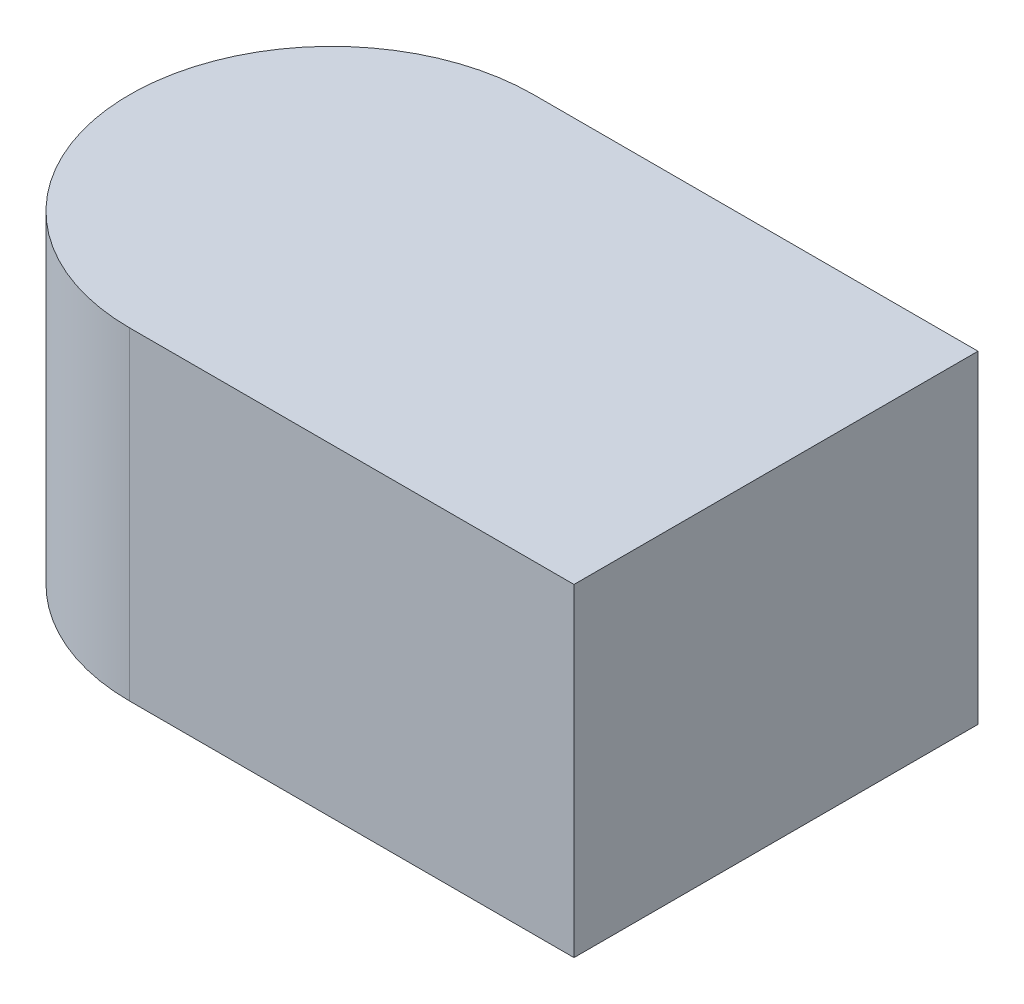
ISO-10303-21;
HEADER;
FILE_DESCRIPTION(('STEP AP214'),'2;1');
FILE_NAME('part.step','',(''),(''),'','','');
FILE_SCHEMA(('AUTOMOTIVE_DESIGN { 1 0 10303 214 1 1 1 1 }'));
ENDSEC;
DATA;
#1=APPLICATION_CONTEXT('core data for automotive mechanical design processes');
#2=APPLICATION_PROTOCOL_DEFINITION('international standard','automotive_design',2000,#1);
#3=PRODUCT_CONTEXT('',#1,'mechanical');
#4=PRODUCT('Part','Part','',(#3));
#5=PRODUCT_RELATED_PRODUCT_CATEGORY('part','',(#4));
#6=PRODUCT_DEFINITION_FORMATION('','',#4);
#7=PRODUCT_DEFINITION_CONTEXT('part definition',#1,'design');
#8=PRODUCT_DEFINITION('design','',#6,#7);
#9=PRODUCT_DEFINITION_SHAPE('','',#8);
#10=(LENGTH_UNIT() NAMED_UNIT(*) SI_UNIT(.MILLI.,.METRE.));
#11=(NAMED_UNIT(*) PLANE_ANGLE_UNIT() SI_UNIT($,.RADIAN.));
#12=(NAMED_UNIT(*) SI_UNIT($,.STERADIAN.) SOLID_ANGLE_UNIT());
#13=UNCERTAINTY_MEASURE_WITH_UNIT(LENGTH_MEASURE(1.E-05),#10,'distance_accuracy_value','');
#14=(GEOMETRIC_REPRESENTATION_CONTEXT(3) GLOBAL_UNCERTAINTY_ASSIGNED_CONTEXT((#13)) GLOBAL_UNIT_ASSIGNED_CONTEXT((#10,
#11,#12)) REPRESENTATION_CONTEXT('',''));
#15=CARTESIAN_POINT('',(0.,0.,0.));
#16=DIRECTION('',(0.,0.,1.));
#17=DIRECTION('',(1.,0.,0.));
#18=AXIS2_PLACEMENT_3D('',#15,#16,#17);
#19=CARTESIAN_POINT('',(0.,0.,0.));
#20=DIRECTION('',(0.,1.,0.));
#21=DIRECTION('',(1.,0.,0.));
#22=AXIS2_PLACEMENT_3D('',#19,#20,#21);
#23=PLANE('',#22);
#24=DIRECTION('',(0.,0.,-1.));
#25=VECTOR('',#24,1.);
#26=CARTESIAN_POINT('',(1.5,0.,0.875));
#27=LINE('',#26,#25);
#28=CARTESIAN_POINT('',(1.5,0.,0.875));
#29=VERTEX_POINT('',#28);
#30=CARTESIAN_POINT('',(1.5,0.,0.625));
#31=VERTEX_POINT('',#30);
#32=EDGE_CURVE('E11',#29,#31,#27,.T.);
#33=ORIENTED_EDGE('',*,*,#32,.F.);
#34=DIRECTION('',(1.,0.,0.));
#35=VECTOR('',#34,1.);
#36=CARTESIAN_POINT('',(1.225,0.,0.875));
#37=LINE('',#36,#35);
#38=CARTESIAN_POINT('',(1.225,0.,0.875));
#39=VERTEX_POINT('',#38);
#40=EDGE_CURVE('E24',#39,#29,#37,.T.);
#41=ORIENTED_EDGE('',*,*,#40,.F.);
#42=CARTESIAN_POINT('',(1.225,0.,0.75));
#43=DIRECTION('',(0.,1.,0.));
#44=DIRECTION('',(0.,0.,-1.));
#45=AXIS2_PLACEMENT_3D('',#42,#43,#44);
#46=CIRCLE('',#45,0.125);
#47=CARTESIAN_POINT('',(1.225,0.,0.625));
#48=VERTEX_POINT('',#47);
#49=EDGE_CURVE('E61',#48,#39,#46,.T.);
#50=ORIENTED_EDGE('',*,*,#49,.F.);
#51=DIRECTION('',(-1.,0.,0.));
#52=VECTOR('',#51,1.);
#53=CARTESIAN_POINT('',(1.5,0.,0.625));
#54=LINE('',#53,#52);
#55=EDGE_CURVE('E37',#31,#48,#54,.T.);
#56=ORIENTED_EDGE('',*,*,#55,.F.);
#57=EDGE_LOOP('',(#33,#41,#50,#56));
#58=FACE_BOUND('',#57,.T.);
#59=ADVANCED_FACE('F17',(#58),#23,.F.);
#60=CARTESIAN_POINT('',(1.5,0.,0.625));
#61=DIRECTION('',(0.,0.,-1.));
#62=DIRECTION('',(-1.,0.,0.));
#63=AXIS2_PLACEMENT_3D('',#60,#61,#62);
#64=PLANE('',#63);
#65=DIRECTION('',(0.,1.,0.));
#66=VECTOR('',#65,1.);
#67=CARTESIAN_POINT('',(1.225,0.,0.625));
#68=LINE('',#67,#66);
#69=CARTESIAN_POINT('',(1.225,0.2,0.625));
#70=VERTEX_POINT('',#69);
#71=EDGE_CURVE('E84',#48,#70,#68,.T.);
#72=ORIENTED_EDGE('',*,*,#71,.T.);
#73=DIRECTION('',(-1.,0.,0.));
#74=VECTOR('',#73,1.);
#75=CARTESIAN_POINT('',(1.5,0.2,0.625));
#76=LINE('',#75,#74);
#77=CARTESIAN_POINT('',(1.5,0.2,0.625));
#78=VERTEX_POINT('',#77);
#79=EDGE_CURVE('E74',#78,#70,#76,.T.);
#80=ORIENTED_EDGE('',*,*,#79,.F.);
#81=DIRECTION('',(0.,1.,0.));
#82=VECTOR('',#81,1.);
#83=CARTESIAN_POINT('',(1.5,0.,0.625));
#84=LINE('',#83,#82);
#85=EDGE_CURVE('E81',#31,#78,#84,.T.);
#86=ORIENTED_EDGE('',*,*,#85,.F.);
#87=ORIENTED_EDGE('',*,*,#55,.T.);
#88=EDGE_LOOP('',(#72,#80,#86,#87));
#89=FACE_BOUND('',#88,.T.);
#90=ADVANCED_FACE('F89',(#89),#64,.T.);
#91=CARTESIAN_POINT('',(1.5,0.,0.875));
#92=DIRECTION('',(1.,0.,0.));
#93=DIRECTION('',(0.,0.,-1.));
#94=AXIS2_PLACEMENT_3D('',#91,#92,#93);
#95=PLANE('',#94);
#96=ORIENTED_EDGE('',*,*,#85,.T.);
#97=DIRECTION('',(0.,0.,-1.));
#98=VECTOR('',#97,1.);
#99=CARTESIAN_POINT('',(1.5,0.2,0.875));
#100=LINE('',#99,#98);
#101=CARTESIAN_POINT('',(1.5,0.2,0.875));
#102=VERTEX_POINT('',#101);
#103=EDGE_CURVE('E79',#102,#78,#100,.T.);
#104=ORIENTED_EDGE('',*,*,#103,.F.);
#105=DIRECTION('',(0.,1.,0.));
#106=VECTOR('',#105,1.);
#107=CARTESIAN_POINT('',(1.5,0.,0.875));
#108=LINE('',#107,#106);
#109=EDGE_CURVE('E67',#29,#102,#108,.T.);
#110=ORIENTED_EDGE('',*,*,#109,.F.);
#111=ORIENTED_EDGE('',*,*,#32,.T.);
#112=EDGE_LOOP('',(#96,#104,#110,#111));
#113=FACE_BOUND('',#112,.T.);
#114=ADVANCED_FACE('F91',(#113),#95,.T.);
#115=CARTESIAN_POINT('',(1.225,0.,0.875));
#116=DIRECTION('',(0.,0.,1.));
#117=DIRECTION('',(1.,0.,0.));
#118=AXIS2_PLACEMENT_3D('',#115,#116,#117);
#119=PLANE('',#118);
#120=ORIENTED_EDGE('',*,*,#109,.T.);
#121=DIRECTION('',(1.,0.,0.));
#122=VECTOR('',#121,1.);
#123=CARTESIAN_POINT('',(1.225,0.2,0.875));
#124=LINE('',#123,#122);
#125=CARTESIAN_POINT('',(1.225,0.2,0.875));
#126=VERTEX_POINT('',#125);
#127=EDGE_CURVE('E62',#126,#102,#124,.T.);
#128=ORIENTED_EDGE('',*,*,#127,.F.);
#129=DIRECTION('',(0.,1.,0.));
#130=VECTOR('',#129,1.);
#131=CARTESIAN_POINT('',(1.225,0.,0.875));
#132=LINE('',#131,#130);
#133=EDGE_CURVE('E55',#39,#126,#132,.T.);
#134=ORIENTED_EDGE('',*,*,#133,.F.);
#135=ORIENTED_EDGE('',*,*,#40,.T.);
#136=EDGE_LOOP('',(#120,#128,#134,#135));
#137=FACE_BOUND('',#136,.T.);
#138=ADVANCED_FACE('F65',(#137),#119,.T.);
#139=CARTESIAN_POINT('',(1.225,0.,0.75));
#140=DIRECTION('',(0.,1.,0.));
#141=DIRECTION('',(1.,0.,0.));
#142=AXIS2_PLACEMENT_3D('',#139,#140,#141);
#143=CYLINDRICAL_SURFACE('',#142,0.125);
#144=ORIENTED_EDGE('',*,*,#133,.T.);
#145=CARTESIAN_POINT('',(1.225,0.2,0.75));
#146=DIRECTION('',(0.,1.,0.));
#147=DIRECTION('',(0.,0.,-1.));
#148=AXIS2_PLACEMENT_3D('',#145,#146,#147);
#149=CIRCLE('',#148,0.125);
#150=EDGE_CURVE('E60',#70,#126,#149,.T.);
#151=ORIENTED_EDGE('',*,*,#150,.F.);
#152=ORIENTED_EDGE('',*,*,#71,.F.);
#153=ORIENTED_EDGE('',*,*,#49,.T.);
#154=EDGE_LOOP('',(#144,#151,#152,#153));
#155=FACE_BOUND('',#154,.T.);
#156=ADVANCED_FACE('F57',(#155),#143,.T.);
#157=CARTESIAN_POINT('',(0.,0.2,0.));
#158=DIRECTION('',(0.,1.,0.));
#159=DIRECTION('',(1.,0.,0.));
#160=AXIS2_PLACEMENT_3D('',#157,#158,#159);
#161=PLANE('',#160);
#162=ORIENTED_EDGE('',*,*,#150,.T.);
#163=ORIENTED_EDGE('',*,*,#127,.T.);
#164=ORIENTED_EDGE('',*,*,#103,.T.);
#165=ORIENTED_EDGE('',*,*,#79,.T.);
#166=EDGE_LOOP('',(#162,#163,#164,#165));
#167=FACE_BOUND('',#166,.T.);
#168=ADVANCED_FACE('F72',(#167),#161,.T.);
#169=CLOSED_SHELL('',(#59,#90,#114,#138,#156,#168));
#170=MANIFOLD_SOLID_BREP('B1',#169);
#171=ADVANCED_BREP_SHAPE_REPRESENTATION('',(#18,#170),#14);
#172=SHAPE_DEFINITION_REPRESENTATION(#9,#171);
ENDSEC;
END-ISO-10303-21;
